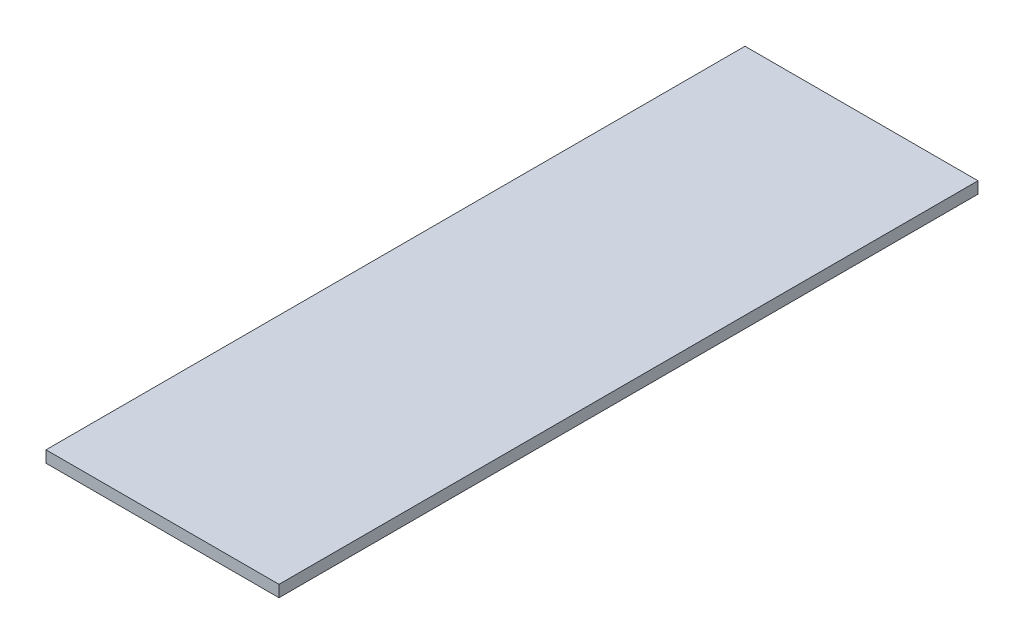
ISO-10303-21;
HEADER;
FILE_DESCRIPTION(('STEP AP214'),'2;1');
FILE_NAME('part.step','',(''),(''),'','','');
FILE_SCHEMA(('AUTOMOTIVE_DESIGN { 1 0 10303 214 1 1 1 1 }'));
ENDSEC;
DATA;
#1=APPLICATION_CONTEXT('core data for automotive mechanical design processes');
#2=APPLICATION_PROTOCOL_DEFINITION('international standard','automotive_design',2000,#1);
#3=PRODUCT_CONTEXT('',#1,'mechanical');
#4=PRODUCT('Part','Part','',(#3));
#5=PRODUCT_RELATED_PRODUCT_CATEGORY('part','',(#4));
#6=PRODUCT_DEFINITION_FORMATION('','',#4);
#7=PRODUCT_DEFINITION_CONTEXT('part definition',#1,'design');
#8=PRODUCT_DEFINITION('design','',#6,#7);
#9=PRODUCT_DEFINITION_SHAPE('','',#8);
#10=(LENGTH_UNIT() NAMED_UNIT(*) SI_UNIT(.MILLI.,.METRE.));
#11=(NAMED_UNIT(*) PLANE_ANGLE_UNIT() SI_UNIT($,.RADIAN.));
#12=(NAMED_UNIT(*) SI_UNIT($,.STERADIAN.) SOLID_ANGLE_UNIT());
#13=UNCERTAINTY_MEASURE_WITH_UNIT(LENGTH_MEASURE(1.E-05),#10,'distance_accuracy_value','');
#14=(GEOMETRIC_REPRESENTATION_CONTEXT(3) GLOBAL_UNCERTAINTY_ASSIGNED_CONTEXT((#13)) GLOBAL_UNIT_ASSIGNED_CONTEXT((#10,
#11,#12)) REPRESENTATION_CONTEXT('',''));
#15=CARTESIAN_POINT('',(0.,0.,0.));
#16=DIRECTION('',(0.,0.,1.));
#17=DIRECTION('',(1.,0.,0.));
#18=AXIS2_PLACEMENT_3D('',#15,#16,#17);
#19=CARTESIAN_POINT('',(50.,5.,150.));
#20=DIRECTION('',(-1.,0.,0.));
#21=DIRECTION('',(0.,0.,1.));
#22=AXIS2_PLACEMENT_3D('',#19,#20,#21);
#23=PLANE('',#22);
#24=DIRECTION('',(0.,0.,-1.));
#25=VECTOR('',#24,1.);
#26=CARTESIAN_POINT('',(50.,0.,150.));
#27=LINE('',#26,#25);
#28=CARTESIAN_POINT('',(50.,0.,150.));
#29=VERTEX_POINT('',#28);
#30=CARTESIAN_POINT('',(50.,0.,-150.));
#31=VERTEX_POINT('',#30);
#32=EDGE_CURVE('E98',#29,#31,#27,.T.);
#33=ORIENTED_EDGE('',*,*,#32,.T.);
#34=DIRECTION('',(0.,-1.,0.));
#35=VECTOR('',#34,1.);
#36=CARTESIAN_POINT('',(50.,5.,-150.));
#37=LINE('',#36,#35);
#38=CARTESIAN_POINT('',(50.,5.,-150.));
#39=VERTEX_POINT('',#38);
#40=EDGE_CURVE('E11',#39,#31,#37,.T.);
#41=ORIENTED_EDGE('',*,*,#40,.F.);
#42=DIRECTION('',(0.,0.,-1.));
#43=VECTOR('',#42,1.);
#44=CARTESIAN_POINT('',(50.,5.,150.));
#45=LINE('',#44,#43);
#46=CARTESIAN_POINT('',(50.,5.,150.));
#47=VERTEX_POINT('',#46);
#48=EDGE_CURVE('E86',#47,#39,#45,.T.);
#49=ORIENTED_EDGE('',*,*,#48,.F.);
#50=DIRECTION('',(0.,-1.,0.));
#51=VECTOR('',#50,1.);
#52=CARTESIAN_POINT('',(50.,5.,150.));
#53=LINE('',#52,#51);
#54=EDGE_CURVE('E94',#47,#29,#53,.T.);
#55=ORIENTED_EDGE('',*,*,#54,.T.);
#56=EDGE_LOOP('',(#33,#41,#49,#55));
#57=FACE_BOUND('',#56,.T.);
#58=ADVANCED_FACE('F35',(#57),#23,.F.);
#59=CARTESIAN_POINT('',(-50.,5.,-150.));
#60=DIRECTION('',(0.,0.,1.));
#61=DIRECTION('',(1.,0.,0.));
#62=AXIS2_PLACEMENT_3D('',#59,#60,#61);
#63=PLANE('',#62);
#64=DIRECTION('',(-1.,0.,0.));
#65=VECTOR('',#64,1.);
#66=CARTESIAN_POINT('',(-50.,0.,-150.));
#67=LINE('',#66,#65);
#68=CARTESIAN_POINT('',(-50.,0.,-150.));
#69=VERTEX_POINT('',#68);
#70=EDGE_CURVE('E90',#31,#69,#67,.T.);
#71=ORIENTED_EDGE('',*,*,#70,.T.);
#72=DIRECTION('',(0.,-1.,0.));
#73=VECTOR('',#72,1.);
#74=CARTESIAN_POINT('',(-50.,5.,-150.));
#75=LINE('',#74,#73);
#76=CARTESIAN_POINT('',(-50.,5.,-150.));
#77=VERTEX_POINT('',#76);
#78=EDGE_CURVE('E43',#77,#69,#75,.T.);
#79=ORIENTED_EDGE('',*,*,#78,.F.);
#80=DIRECTION('',(-1.,0.,0.));
#81=VECTOR('',#80,1.);
#82=CARTESIAN_POINT('',(-50.,5.,-150.));
#83=LINE('',#82,#81);
#84=EDGE_CURVE('E81',#39,#77,#83,.T.);
#85=ORIENTED_EDGE('',*,*,#84,.F.);
#86=ORIENTED_EDGE('',*,*,#40,.T.);
#87=EDGE_LOOP('',(#71,#79,#85,#86));
#88=FACE_BOUND('',#87,.T.);
#89=ADVANCED_FACE('F89',(#88),#63,.F.);
#90=CARTESIAN_POINT('',(-50.,5.,150.));
#91=DIRECTION('',(1.,0.,0.));
#92=DIRECTION('',(0.,0.,-1.));
#93=AXIS2_PLACEMENT_3D('',#90,#91,#92);
#94=PLANE('',#93);
#95=DIRECTION('',(0.,0.,1.));
#96=VECTOR('',#95,1.);
#97=CARTESIAN_POINT('',(-50.,0.,150.));
#98=LINE('',#97,#96);
#99=CARTESIAN_POINT('',(-50.,0.,150.));
#100=VERTEX_POINT('',#99);
#101=EDGE_CURVE('E68',#69,#100,#98,.T.);
#102=ORIENTED_EDGE('',*,*,#101,.T.);
#103=DIRECTION('',(0.,-1.,0.));
#104=VECTOR('',#103,1.);
#105=CARTESIAN_POINT('',(-50.,5.,150.));
#106=LINE('',#105,#104);
#107=CARTESIAN_POINT('',(-50.,5.,150.));
#108=VERTEX_POINT('',#107);
#109=EDGE_CURVE('E91',#108,#100,#106,.T.);
#110=ORIENTED_EDGE('',*,*,#109,.F.);
#111=DIRECTION('',(0.,0.,1.));
#112=VECTOR('',#111,1.);
#113=CARTESIAN_POINT('',(-50.,5.,150.));
#114=LINE('',#113,#112);
#115=EDGE_CURVE('E84',#77,#108,#114,.T.);
#116=ORIENTED_EDGE('',*,*,#115,.F.);
#117=ORIENTED_EDGE('',*,*,#78,.T.);
#118=EDGE_LOOP('',(#102,#110,#116,#117));
#119=FACE_BOUND('',#118,.T.);
#120=ADVANCED_FACE('F92',(#119),#94,.F.);
#121=CARTESIAN_POINT('',(-50.,5.,150.));
#122=DIRECTION('',(0.,0.,-1.));
#123=DIRECTION('',(-1.,0.,0.));
#124=AXIS2_PLACEMENT_3D('',#121,#122,#123);
#125=PLANE('',#124);
#126=DIRECTION('',(1.,0.,0.));
#127=VECTOR('',#126,1.);
#128=CARTESIAN_POINT('',(-50.,0.,150.));
#129=LINE('',#128,#127);
#130=EDGE_CURVE('E74',#100,#29,#129,.T.);
#131=ORIENTED_EDGE('',*,*,#130,.T.);
#132=ORIENTED_EDGE('',*,*,#54,.F.);
#133=DIRECTION('',(1.,0.,0.));
#134=VECTOR('',#133,1.);
#135=CARTESIAN_POINT('',(-50.,5.,150.));
#136=LINE('',#135,#134);
#137=EDGE_CURVE('E51',#108,#47,#136,.T.);
#138=ORIENTED_EDGE('',*,*,#137,.F.);
#139=ORIENTED_EDGE('',*,*,#109,.T.);
#140=EDGE_LOOP('',(#131,#132,#138,#139));
#141=FACE_BOUND('',#140,.T.);
#142=ADVANCED_FACE('F105',(#141),#125,.F.);
#143=CARTESIAN_POINT('',(0.,5.,0.));
#144=DIRECTION('',(0.,-1.,0.));
#145=DIRECTION('',(0.,0.,-1.));
#146=AXIS2_PLACEMENT_3D('',#143,#144,#145);
#147=PLANE('',#146);
#148=ORIENTED_EDGE('',*,*,#48,.T.);
#149=ORIENTED_EDGE('',*,*,#84,.T.);
#150=ORIENTED_EDGE('',*,*,#115,.T.);
#151=ORIENTED_EDGE('',*,*,#137,.T.);
#152=EDGE_LOOP('',(#148,#149,#150,#151));
#153=FACE_BOUND('',#152,.T.);
#154=ADVANCED_FACE('F82',(#153),#147,.F.);
#155=CARTESIAN_POINT('',(0.,0.,0.));
#156=DIRECTION('',(0.,-1.,0.));
#157=DIRECTION('',(0.,0.,-1.));
#158=AXIS2_PLACEMENT_3D('',#155,#156,#157);
#159=PLANE('',#158);
#160=ORIENTED_EDGE('',*,*,#32,.F.);
#161=ORIENTED_EDGE('',*,*,#130,.F.);
#162=ORIENTED_EDGE('',*,*,#101,.F.);
#163=ORIENTED_EDGE('',*,*,#70,.F.);
#164=EDGE_LOOP('',(#160,#161,#162,#163));
#165=FACE_BOUND('',#164,.T.);
#166=ADVANCED_FACE('F108',(#165),#159,.T.);
#167=CLOSED_SHELL('',(#58,#89,#120,#142,#154,#166));
#168=MANIFOLD_SOLID_BREP('B2',#167);
#169=ADVANCED_BREP_SHAPE_REPRESENTATION('',(#18,#168),#14);
#170=SHAPE_DEFINITION_REPRESENTATION(#9,#169);
ENDSEC;
END-ISO-10303-21;
